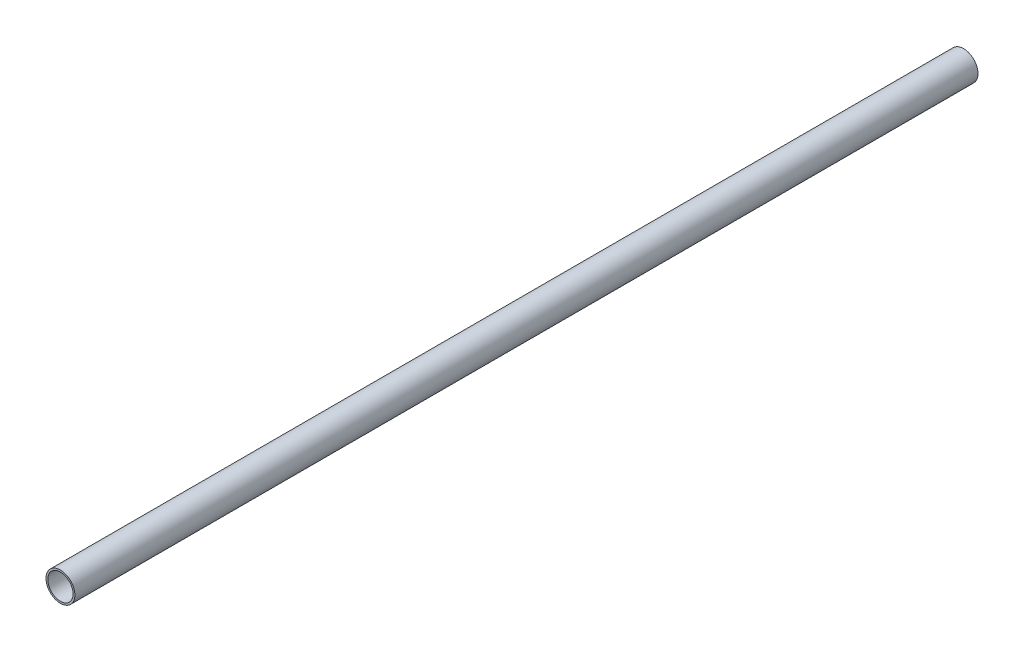
ISO-10303-21;
HEADER;
FILE_DESCRIPTION(('STEP AP214'),'2;1');
FILE_NAME('part.step','',(''),(''),'','','');
FILE_SCHEMA(('AUTOMOTIVE_DESIGN { 1 0 10303 214 1 1 1 1 }'));
ENDSEC;
DATA;
#1=APPLICATION_CONTEXT('core data for automotive mechanical design processes');
#2=APPLICATION_PROTOCOL_DEFINITION('international standard','automotive_design',2000,#1);
#3=PRODUCT_CONTEXT('',#1,'mechanical');
#4=PRODUCT('Part','Part','',(#3));
#5=PRODUCT_RELATED_PRODUCT_CATEGORY('part','',(#4));
#6=PRODUCT_DEFINITION_FORMATION('','',#4);
#7=PRODUCT_DEFINITION_CONTEXT('part definition',#1,'design');
#8=PRODUCT_DEFINITION('design','',#6,#7);
#9=PRODUCT_DEFINITION_SHAPE('','',#8);
#10=(LENGTH_UNIT() NAMED_UNIT(*) SI_UNIT(.MILLI.,.METRE.));
#11=(NAMED_UNIT(*) PLANE_ANGLE_UNIT() SI_UNIT($,.RADIAN.));
#12=(NAMED_UNIT(*) SI_UNIT($,.STERADIAN.) SOLID_ANGLE_UNIT());
#13=UNCERTAINTY_MEASURE_WITH_UNIT(LENGTH_MEASURE(1.E-05),#10,'distance_accuracy_value','');
#14=(GEOMETRIC_REPRESENTATION_CONTEXT(3) GLOBAL_UNCERTAINTY_ASSIGNED_CONTEXT((#13)) GLOBAL_UNIT_ASSIGNED_CONTEXT((#10,
#11,#12)) REPRESENTATION_CONTEXT('',''));
#15=CARTESIAN_POINT('',(0.,0.,0.));
#16=DIRECTION('',(0.,0.,1.));
#17=DIRECTION('',(1.,0.,0.));
#18=AXIS2_PLACEMENT_3D('',#15,#16,#17);
#19=CARTESIAN_POINT('',(0.,0.,250.));
#20=DIRECTION('',(0.,0.,1.));
#21=DIRECTION('',(1.,0.,0.));
#22=AXIS2_PLACEMENT_3D('',#19,#20,#21);
#23=PLANE('',#22);
#24=CARTESIAN_POINT('',(0.,0.,250.));
#25=DIRECTION('',(0.,0.,1.));
#26=DIRECTION('',(1.,0.,0.));
#27=AXIS2_PLACEMENT_3D('',#24,#25,#26);
#28=CIRCLE('',#27,8.);
#29=CARTESIAN_POINT('',(8.,0.,250.));
#30=VERTEX_POINT('',#29);
#31=EDGE_CURVE('E10',#30,#30,#28,.T.);
#32=ORIENTED_EDGE('',*,*,#31,.T.);
#33=EDGE_LOOP('',(#32));
#34=FACE_BOUND('',#33,.T.);
#35=CARTESIAN_POINT('',(0.,0.,250.));
#36=DIRECTION('',(0.,0.,1.));
#37=DIRECTION('',(1.,0.,0.));
#38=AXIS2_PLACEMENT_3D('',#35,#36,#37);
#39=CIRCLE('',#38,7.);
#40=CARTESIAN_POINT('',(7.,0.,250.));
#41=VERTEX_POINT('',#40);
#42=EDGE_CURVE('E50',#41,#41,#39,.T.);
#43=ORIENTED_EDGE('',*,*,#42,.F.);
#44=EDGE_LOOP('',(#43));
#45=FACE_BOUND('',#44,.T.);
#46=ADVANCED_FACE('F37',(#34,#45),#23,.T.);
#47=CARTESIAN_POINT('',(0.,0.,-250.));
#48=DIRECTION('',(0.,0.,1.));
#49=DIRECTION('',(1.,0.,0.));
#50=AXIS2_PLACEMENT_3D('',#47,#48,#49);
#51=PLANE('',#50);
#52=CARTESIAN_POINT('',(0.,0.,-250.));
#53=DIRECTION('',(0.,0.,1.));
#54=DIRECTION('',(1.,0.,0.));
#55=AXIS2_PLACEMENT_3D('',#52,#53,#54);
#56=CIRCLE('',#55,8.);
#57=CARTESIAN_POINT('',(8.,0.,-250.));
#58=VERTEX_POINT('',#57);
#59=EDGE_CURVE('E41',#58,#58,#56,.T.);
#60=ORIENTED_EDGE('',*,*,#59,.F.);
#61=EDGE_LOOP('',(#60));
#62=FACE_BOUND('',#61,.T.);
#63=CARTESIAN_POINT('',(0.,0.,-250.));
#64=DIRECTION('',(0.,0.,1.));
#65=DIRECTION('',(1.,0.,0.));
#66=AXIS2_PLACEMENT_3D('',#63,#64,#65);
#67=CIRCLE('',#66,7.);
#68=CARTESIAN_POINT('',(7.,0.,-250.));
#69=VERTEX_POINT('',#68);
#70=EDGE_CURVE('E52',#69,#69,#67,.T.);
#71=ORIENTED_EDGE('',*,*,#70,.T.);
#72=EDGE_LOOP('',(#71));
#73=FACE_BOUND('',#72,.T.);
#74=ADVANCED_FACE('F64',(#62,#73),#51,.F.);
#75=CARTESIAN_POINT('',(0.,0.,250.));
#76=DIRECTION('',(0.,0.,-1.));
#77=DIRECTION('',(-1.,0.,0.));
#78=AXIS2_PLACEMENT_3D('',#75,#76,#77);
#79=CYLINDRICAL_SURFACE('',#78,8.);
#80=ORIENTED_EDGE('',*,*,#31,.F.);
#81=EDGE_LOOP('',(#80));
#82=FACE_BOUND('',#81,.T.);
#83=ORIENTED_EDGE('',*,*,#59,.T.);
#84=EDGE_LOOP('',(#83));
#85=FACE_BOUND('',#84,.T.);
#86=ADVANCED_FACE('F39',(#82,#85),#79,.T.);
#87=CARTESIAN_POINT('',(0.,0.,250.));
#88=DIRECTION('',(0.,0.,-1.));
#89=DIRECTION('',(-1.,0.,0.));
#90=AXIS2_PLACEMENT_3D('',#87,#88,#89);
#91=CYLINDRICAL_SURFACE('',#90,7.);
#92=ORIENTED_EDGE('',*,*,#42,.T.);
#93=EDGE_LOOP('',(#92));
#94=FACE_BOUND('',#93,.T.);
#95=ORIENTED_EDGE('',*,*,#70,.F.);
#96=EDGE_LOOP('',(#95));
#97=FACE_BOUND('',#96,.T.);
#98=ADVANCED_FACE('F60',(#94,#97),#91,.F.);
#99=CLOSED_SHELL('',(#46,#74,#86,#98));
#100=MANIFOLD_SOLID_BREP('B2',#99);
#101=ADVANCED_BREP_SHAPE_REPRESENTATION('',(#18,#100),#14);
#102=SHAPE_DEFINITION_REPRESENTATION(#9,#101);
ENDSEC;
END-ISO-10303-21;
